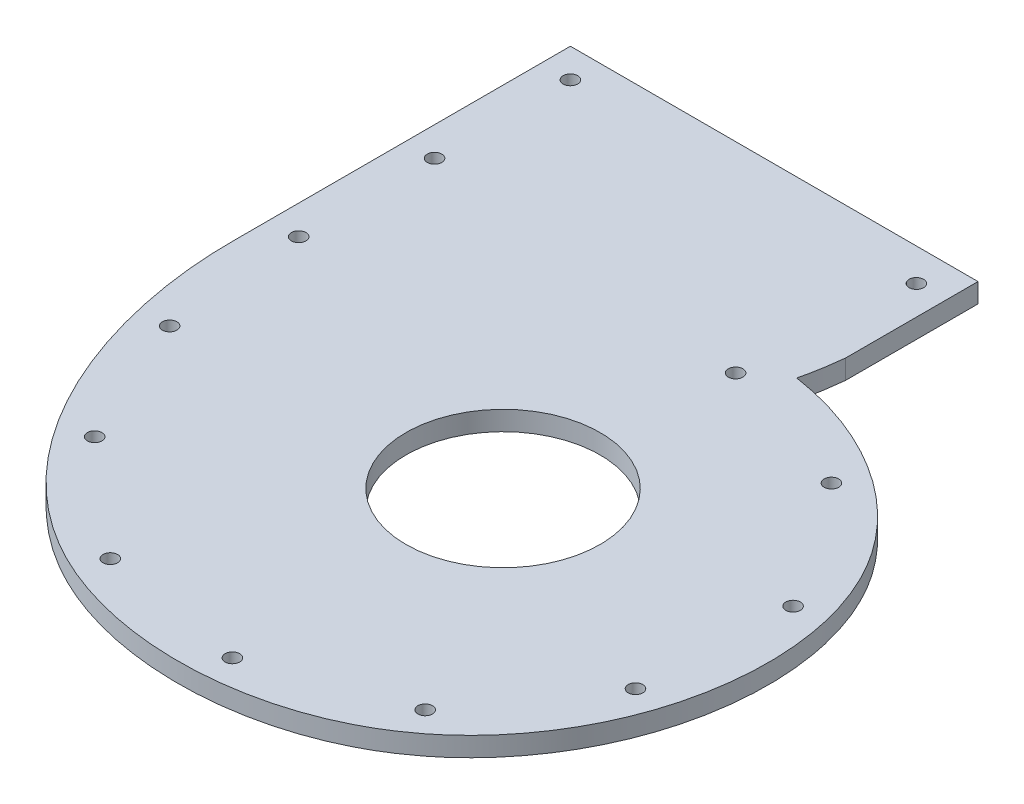
ISO-10303-21;
HEADER;
FILE_DESCRIPTION(('STEP AP214'),'2;1');
FILE_NAME('part.step','',(''),(''),'','','');
FILE_SCHEMA(('AUTOMOTIVE_DESIGN { 1 0 10303 214 1 1 1 1 }'));
ENDSEC;
DATA;
#1=APPLICATION_CONTEXT('core data for automotive mechanical design processes');
#2=APPLICATION_PROTOCOL_DEFINITION('international standard','automotive_design',2000,#1);
#3=PRODUCT_CONTEXT('',#1,'mechanical');
#4=PRODUCT('Part','Part','',(#3));
#5=PRODUCT_RELATED_PRODUCT_CATEGORY('part','',(#4));
#6=PRODUCT_DEFINITION_FORMATION('','',#4);
#7=PRODUCT_DEFINITION_CONTEXT('part definition',#1,'design');
#8=PRODUCT_DEFINITION('design','',#6,#7);
#9=PRODUCT_DEFINITION_SHAPE('','',#8);
#10=(LENGTH_UNIT() NAMED_UNIT(*) SI_UNIT(.MILLI.,.METRE.));
#11=(NAMED_UNIT(*) PLANE_ANGLE_UNIT() SI_UNIT($,.RADIAN.));
#12=(NAMED_UNIT(*) SI_UNIT($,.STERADIAN.) SOLID_ANGLE_UNIT());
#13=UNCERTAINTY_MEASURE_WITH_UNIT(LENGTH_MEASURE(1.E-05),#10,'distance_accuracy_value','');
#14=(GEOMETRIC_REPRESENTATION_CONTEXT(3) GLOBAL_UNCERTAINTY_ASSIGNED_CONTEXT((#13)) GLOBAL_UNIT_ASSIGNED_CONTEXT((#10,
#11,#12)) REPRESENTATION_CONTEXT('',''));
#15=CARTESIAN_POINT('',(0.,0.,0.));
#16=DIRECTION('',(0.,0.,1.));
#17=DIRECTION('',(1.,0.,0.));
#18=AXIS2_PLACEMENT_3D('',#15,#16,#17);
#19=CARTESIAN_POINT('',(19.05,6.35,-93.0525131214236));
#20=CARTESIAN_POINT('',(19.0235717626698,6.35,-92.8091366928728));
#21=CARTESIAN_POINT('',(18.9836928683942,6.35,-92.4430892244958));
#22=CARTESIAN_POINT('',(18.9314671624808,6.35,-91.9589572355302));
#23=CARTESIAN_POINT('',(18.8623607981838,6.35,-91.3379157509415));
#24=CARTESIAN_POINT('',(18.7762928711156,6.35,-90.6107808851603));
#25=CARTESIAN_POINT('',(18.6259027213404,6.35,-89.4251283904721));
#26=CARTESIAN_POINT('',(18.4201228683112,6.35,-87.9598584476399));
#27=CARTESIAN_POINT('',(18.0499905632596,6.35,-85.6275758075247));
#28=CARTESIAN_POINT('',(17.5101435713735,6.35,-82.7435971471794));
#29=CARTESIAN_POINT('',(16.996105498509,6.35,-80.4784646355363));
#30=CARTESIAN_POINT('',(16.7159863913014,6.35,-79.3485680085002));
#31=B_SPLINE_CURVE_WITH_KNOTS('',3,(#19,#20,#21,#22,#23,#24,#25,#26,#27,#28,#29,#30),
.UNSPECIFIED.,.F.,.F.,(4,1,1,1,1,1,1,1,1,4),(-0.0228949743215874,-0.00659054938911569,
0.00156166307712017,0.00971387554335602,0.0260183004758277,0.0423227254082994,
0.0749315752732429,0.107540425138186,0.172758124868073,0.23797582459796),.UNSPECIFIED.);
#32=DIRECTION('',(0.,-1.,0.));
#33=VECTOR('',#32,1.);
#34=SURFACE_OF_LINEAR_EXTRUSION('',#31,#33);
#35=CARTESIAN_POINT('',(19.05,0.,-93.0525131214236));
#36=CARTESIAN_POINT('',(19.0235717626698,0.,-92.8091366928728));
#37=CARTESIAN_POINT('',(18.9836928683942,0.,-92.4430892244958));
#38=CARTESIAN_POINT('',(18.9314671624808,0.,-91.9589572355302));
#39=CARTESIAN_POINT('',(18.8623607981838,0.,-91.3379157509415));
#40=CARTESIAN_POINT('',(18.7762928711156,0.,-90.6107808851603));
#41=CARTESIAN_POINT('',(18.6259027213404,0.,-89.4251283904721));
#42=CARTESIAN_POINT('',(18.4201228683112,0.,-87.9598584476399));
#43=CARTESIAN_POINT('',(18.0499905632596,0.,-85.6275758075247));
#44=CARTESIAN_POINT('',(17.5101435713735,0.,-82.7435971471794));
#45=CARTESIAN_POINT('',(16.996105498509,0.,-80.4784646355363));
#46=CARTESIAN_POINT('',(16.7159863913014,0.,-79.3485680085002));
#47=B_SPLINE_CURVE_WITH_KNOTS('',3,(#35,#36,#37,#38,#39,#40,#41,#42,#43,#44,#45,#46),
.UNSPECIFIED.,.F.,.F.,(4,1,1,1,1,1,1,1,1,4),(-0.0228949743215874,-0.00659054938911569,
0.00156166307712017,0.00971387554335602,0.0260183004758277,0.0423227254082994,
0.0749315752732429,0.107540425138186,0.172758124868073,0.23797582459796),.UNSPECIFIED.);
#48=CARTESIAN_POINT('',(19.05,0.,-93.0525131214236));
#49=VERTEX_POINT('',#48);
#50=CARTESIAN_POINT('',(16.7159863913014,0.,-79.3485680085002));
#51=VERTEX_POINT('',#50);
#52=EDGE_CURVE('E145',#49,#51,#47,.T.);
#53=ORIENTED_EDGE('',*,*,#52,.F.);
#54=DIRECTION('',(0.,-1.,0.));
#55=VECTOR('',#54,1.);
#56=CARTESIAN_POINT('',(19.05,6.35,-93.0525131214236));
#57=LINE('',#56,#55);
#58=CARTESIAN_POINT('',(19.05,6.35,-93.0525131214236));
#59=VERTEX_POINT('',#58);
#60=EDGE_CURVE('E13',#59,#49,#57,.T.);
#61=ORIENTED_EDGE('',*,*,#60,.F.);
#62=CARTESIAN_POINT('',(16.7159863913014,6.35,-79.3485680085002));
#63=VERTEX_POINT('',#62);
#64=EDGE_CURVE('E182',#59,#63,#31,.T.);
#65=ORIENTED_EDGE('',*,*,#64,.T.);
#66=DIRECTION('',(0.,-1.,0.));
#67=VECTOR('',#66,1.);
#68=CARTESIAN_POINT('',(16.7159863913014,6.35,-79.3485680085002));
#69=LINE('',#68,#67);
#70=EDGE_CURVE('E84',#63,#51,#69,.T.);
#71=ORIENTED_EDGE('',*,*,#70,.T.);
#72=EDGE_LOOP('',(#53,#61,#65,#71));
#73=FACE_BOUND('',#72,.T.);
#74=ADVANCED_FACE('F67',(#73),#34,.T.);
#75=CARTESIAN_POINT('',(19.05,6.35,0.));
#76=DIRECTION('',(1.,0.,0.));
#77=DIRECTION('',(0.,0.,-1.));
#78=AXIS2_PLACEMENT_3D('',#75,#76,#77);
#79=PLANE('',#78);
#80=DIRECTION('',(0.,0.,1.));
#81=VECTOR('',#80,1.);
#82=CARTESIAN_POINT('',(19.05,0.,0.));
#83=LINE('',#82,#81);
#84=CARTESIAN_POINT('',(19.05,0.,-136.334024978483));
#85=VERTEX_POINT('',#84);
#86=EDGE_CURVE('E170',#85,#49,#83,.T.);
#87=ORIENTED_EDGE('',*,*,#86,.F.);
#88=DIRECTION('',(0.,-1.,0.));
#89=VECTOR('',#88,1.);
#90=CARTESIAN_POINT('',(19.05,6.35,-136.334024978483));
#91=LINE('',#90,#89);
#92=CARTESIAN_POINT('',(19.05,6.35,-136.334024978483));
#93=VERTEX_POINT('',#92);
#94=EDGE_CURVE('E76',#93,#85,#91,.T.);
#95=ORIENTED_EDGE('',*,*,#94,.F.);
#96=DIRECTION('',(0.,0.,1.));
#97=VECTOR('',#96,1.);
#98=CARTESIAN_POINT('',(19.05,6.35,0.));
#99=LINE('',#98,#97);
#100=EDGE_CURVE('E125',#93,#59,#99,.T.);
#101=ORIENTED_EDGE('',*,*,#100,.T.);
#102=ORIENTED_EDGE('',*,*,#60,.T.);
#103=EDGE_LOOP('',(#87,#95,#101,#102));
#104=FACE_BOUND('',#103,.T.);
#105=ADVANCED_FACE('F162',(#104),#79,.T.);
#106=CARTESIAN_POINT('',(0.,6.35,-136.334024978483));
#107=DIRECTION('',(0.,0.,1.));
#108=DIRECTION('',(1.,0.,0.));
#109=AXIS2_PLACEMENT_3D('',#106,#107,#108);
#110=PLANE('',#109);
#111=DIRECTION('',(-1.,0.,0.));
#112=VECTOR('',#111,1.);
#113=CARTESIAN_POINT('',(0.,0.,-136.334024978483));
#114=LINE('',#113,#112);
#115=CARTESIAN_POINT('',(-114.3,0.,-136.334024978483));
#116=VERTEX_POINT('',#115);
#117=EDGE_CURVE('E132',#85,#116,#114,.T.);
#118=ORIENTED_EDGE('',*,*,#117,.T.);
#119=DIRECTION('',(0.,-1.,0.));
#120=VECTOR('',#119,1.);
#121=CARTESIAN_POINT('',(-114.3,6.35,-136.334024978483));
#122=LINE('',#121,#120);
#123=CARTESIAN_POINT('',(-114.3,6.35,-136.334024978483));
#124=VERTEX_POINT('',#123);
#125=EDGE_CURVE('E130',#124,#116,#122,.T.);
#126=ORIENTED_EDGE('',*,*,#125,.F.);
#127=DIRECTION('',(-1.,0.,0.));
#128=VECTOR('',#127,1.);
#129=CARTESIAN_POINT('',(0.,6.35,-136.334024978483));
#130=LINE('',#129,#128);
#131=EDGE_CURVE('E117',#93,#124,#130,.T.);
#132=ORIENTED_EDGE('',*,*,#131,.F.);
#133=ORIENTED_EDGE('',*,*,#94,.T.);
#134=EDGE_LOOP('',(#118,#126,#132,#133));
#135=FACE_BOUND('',#134,.T.);
#136=ADVANCED_FACE('F131',(#135),#110,.F.);
#137=CARTESIAN_POINT('',(-114.3,6.35,0.));
#138=DIRECTION('',(1.,0.,0.));
#139=DIRECTION('',(0.,0.,-1.));
#140=AXIS2_PLACEMENT_3D('',#137,#138,#139);
#141=PLANE('',#140);
#142=DIRECTION('',(0.,0.,1.));
#143=VECTOR('',#142,1.);
#144=CARTESIAN_POINT('',(-114.3,0.,0.));
#145=LINE('',#144,#143);
#146=CARTESIAN_POINT('',(-114.3,0.,-26.0721112281661));
#147=VERTEX_POINT('',#146);
#148=EDGE_CURVE('E172',#116,#147,#145,.T.);
#149=ORIENTED_EDGE('',*,*,#148,.T.);
#150=DIRECTION('',(0.,-1.,0.));
#151=VECTOR('',#150,1.);
#152=CARTESIAN_POINT('',(-114.3,6.35,-26.0721112281661));
#153=LINE('',#152,#151);
#154=CARTESIAN_POINT('',(-114.3,6.35,-26.0721112281661));
#155=VERTEX_POINT('',#154);
#156=EDGE_CURVE('E101',#155,#147,#153,.T.);
#157=ORIENTED_EDGE('',*,*,#156,.F.);
#158=DIRECTION('',(0.,0.,1.));
#159=VECTOR('',#158,1.);
#160=CARTESIAN_POINT('',(-114.3,6.35,0.));
#161=LINE('',#160,#159);
#162=EDGE_CURVE('E123',#124,#155,#161,.T.);
#163=ORIENTED_EDGE('',*,*,#162,.F.);
#164=ORIENTED_EDGE('',*,*,#125,.T.);
#165=EDGE_LOOP('',(#149,#157,#163,#164));
#166=FACE_BOUND('',#165,.T.);
#167=ADVANCED_FACE('F136',(#166),#141,.F.);
#168=CARTESIAN_POINT('',(16.7159863913014,6.35,-79.3485680085002));
#169=CARTESIAN_POINT('',(21.6330978705224,6.35,-78.6271989598531));
#170=CARTESIAN_POINT('',(31.3718572612699,6.35,-76.3897218941116));
#171=CARTESIAN_POINT('',(45.2492004972199,6.35,-70.8452769607163));
#172=CARTESIAN_POINT('',(58.1427020202069,6.35,-63.2023547019803));
#173=CARTESIAN_POINT('',(69.6942684990019,6.35,-53.48659400402));
#174=CARTESIAN_POINT('',(77.8316458808527,6.35,-43.6787438983676));
#175=CARTESIAN_POINT('',(83.1663553001762,6.35,-34.7783260421134));
#176=CARTESIAN_POINT('',(87.5006566564551,6.35,-25.5003387116442));
#177=CARTESIAN_POINT('',(91.1570644324476,6.35,-13.4000448880706));
#178=CARTESIAN_POINT('',(92.9989240789807,6.35,1.46366621805663));
#179=CARTESIAN_POINT('',(92.5331586276137,6.35,16.3321608555447));
#180=CARTESIAN_POINT('',(89.9113480457351,6.35,30.9228680078494));
#181=CARTESIAN_POINT('',(85.2246697026399,6.35,44.926534482478));
#182=CARTESIAN_POINT('',(78.5424766002794,6.35,58.0873215625547));
#183=CARTESIAN_POINT('',(69.8929665542091,6.35,70.1280882226925));
#184=CARTESIAN_POINT('',(59.3342250850972,6.35,80.7225189459671));
#185=CARTESIAN_POINT('',(46.8082946762808,6.35,89.4843789599546));
#186=CARTESIAN_POINT('',(33.1657508535722,6.35,95.8312045365591));
#187=CARTESIAN_POINT('',(18.8220757998214,6.35,100.000437450495));
#188=CARTESIAN_POINT('',(4.08382286145167,6.35,102.10160242432));
#189=CARTESIAN_POINT('',(-10.7774412230892,6.35,102.21979996101));
#190=CARTESIAN_POINT('',(-25.5048511364746,6.35,100.381408636179));
#191=CARTESIAN_POINT('',(-37.4527415030442,6.35,97.1973224935949));
#192=CARTESIAN_POINT('',(-46.6656390896169,6.35,93.6226539944936));
#193=CARTESIAN_POINT('',(-53.3782339827533,6.35,90.4042691275464));
#194=CARTESIAN_POINT('',(-59.7780191628772,6.35,86.6678318366041));
#195=CARTESIAN_POINT('',(-67.7729642470086,6.35,81.1134949695859));
#196=CARTESIAN_POINT('',(-76.7948383172267,6.35,73.1919966973664));
#197=CARTESIAN_POINT('',(-86.0825071986507,6.35,62.4802459776523));
#198=CARTESIAN_POINT('',(-96.5268651878926,6.35,46.9789350867326));
#199=CARTESIAN_POINT('',(-104.247410810002,6.35,30.1516401250863));
#200=CARTESIAN_POINT('',(-109.533831829891,6.35,12.8006946264713));
#201=CARTESIAN_POINT('',(-112.324631517154,6.35,-0.30605110665803));
#202=CARTESIAN_POINT('',(-113.69827349308,6.35,-11.1587802232802));
#203=CARTESIAN_POINT('',(-114.231429958165,6.35,-19.7408930873515));
#204=CARTESIAN_POINT('',(-114.308990647516,6.35,-23.9549561001606));
#205=CARTESIAN_POINT('',(-114.3,6.35,-26.0721112281661));
#206=B_SPLINE_CURVE_WITH_KNOTS('',3,(#168,#169,#170,#171,#172,#173,#174,#175,#176,#177,#178,
#179,#180,#181,#182,#183,#184,#185,#186,#187,#188,#189,#190,#191,#192,#193,#194,#195,#196,#197,
#198,#199,#200,#201,#202,#203,#204,#205),.UNSPECIFIED.,.F.,.F.,(4,1,1,1,1,1,1,1,1,1,1,1,1,1,1,1,
1,1,1,1,1,1,1,1,1,1,1,1,1,1,1,1,1,1,1,4),(0.0744180317666386,0.103339232907731,
0.132260434048823,0.161181635189916,0.190102836331008,0.2190240374721,0.233484638042646,
0.247945238613193,0.276866439754285,0.305787640895377,0.33470884203647,0.363630043177562,
0.392551244318654,0.421472445459747,0.450393646600839,0.479314847741931,0.508236048883024,
0.537157250024116,0.566078451165208,0.594999652306301,0.623920853447393,0.652842054588485,
0.681763255729578,0.696223856300124,0.71068445687067,0.725145057441216,0.739605658011762,
0.768526859152855,0.797448060293947,0.826369261435039,0.884211663717224,0.913132864858316,
0.942054065999409,0.970975267140501,0.985435867711047,0.999896468281593),.UNSPECIFIED.);
#207=DIRECTION('',(0.,-1.,0.));
#208=VECTOR('',#207,1.);
#209=SURFACE_OF_LINEAR_EXTRUSION('',#206,#208);
#210=CARTESIAN_POINT('',(16.7159863913014,0.,-79.3485680085002));
#211=CARTESIAN_POINT('',(21.6330978705224,0.,-78.6271989598531));
#212=CARTESIAN_POINT('',(31.3718572612699,0.,-76.3897218941116));
#213=CARTESIAN_POINT('',(45.2492004972199,0.,-70.8452769607163));
#214=CARTESIAN_POINT('',(58.1427020202069,0.,-63.2023547019803));
#215=CARTESIAN_POINT('',(69.6942684990019,0.,-53.48659400402));
#216=CARTESIAN_POINT('',(77.8316458808527,0.,-43.6787438983676));
#217=CARTESIAN_POINT('',(83.1663553001762,0.,-34.7783260421134));
#218=CARTESIAN_POINT('',(87.5006566564551,0.,-25.5003387116442));
#219=CARTESIAN_POINT('',(91.1570644324476,0.,-13.4000448880706));
#220=CARTESIAN_POINT('',(92.9989240789807,0.,1.46366621805663));
#221=CARTESIAN_POINT('',(92.5331586276137,0.,16.3321608555447));
#222=CARTESIAN_POINT('',(89.9113480457351,0.,30.9228680078494));
#223=CARTESIAN_POINT('',(85.2246697026399,0.,44.926534482478));
#224=CARTESIAN_POINT('',(78.5424766002794,0.,58.0873215625547));
#225=CARTESIAN_POINT('',(69.8929665542091,0.,70.1280882226925));
#226=CARTESIAN_POINT('',(59.3342250850972,0.,80.7225189459671));
#227=CARTESIAN_POINT('',(46.8082946762808,0.,89.4843789599546));
#228=CARTESIAN_POINT('',(33.1657508535722,0.,95.8312045365591));
#229=CARTESIAN_POINT('',(18.8220757998214,0.,100.000437450495));
#230=CARTESIAN_POINT('',(4.08382286145167,0.,102.10160242432));
#231=CARTESIAN_POINT('',(-10.7774412230892,0.,102.21979996101));
#232=CARTESIAN_POINT('',(-25.5048511364746,0.,100.381408636179));
#233=CARTESIAN_POINT('',(-37.4527415030442,0.,97.1973224935949));
#234=CARTESIAN_POINT('',(-46.6656390896169,0.,93.6226539944936));
#235=CARTESIAN_POINT('',(-53.3782339827533,0.,90.4042691275464));
#236=CARTESIAN_POINT('',(-59.7780191628772,0.,86.6678318366041));
#237=CARTESIAN_POINT('',(-67.7729642470086,0.,81.1134949695859));
#238=CARTESIAN_POINT('',(-76.7948383172267,0.,73.1919966973664));
#239=CARTESIAN_POINT('',(-86.0825071986507,0.,62.4802459776523));
#240=CARTESIAN_POINT('',(-96.5268651878926,0.,46.9789350867326));
#241=CARTESIAN_POINT('',(-104.247410810002,0.,30.1516401250863));
#242=CARTESIAN_POINT('',(-109.533831829891,0.,12.8006946264713));
#243=CARTESIAN_POINT('',(-112.324631517154,0.,-0.30605110665803));
#244=CARTESIAN_POINT('',(-113.69827349308,0.,-11.1587802232802));
#245=CARTESIAN_POINT('',(-114.231429958165,0.,-19.7408930873515));
#246=CARTESIAN_POINT('',(-114.308990647516,0.,-23.9549561001606));
#247=CARTESIAN_POINT('',(-114.3,0.,-26.0721112281661));
#248=B_SPLINE_CURVE_WITH_KNOTS('',3,(#210,#211,#212,#213,#214,#215,#216,#217,#218,#219,#220,
#221,#222,#223,#224,#225,#226,#227,#228,#229,#230,#231,#232,#233,#234,#235,#236,#237,#238,#239,
#240,#241,#242,#243,#244,#245,#246,#247),.UNSPECIFIED.,.F.,.F.,(4,1,1,1,1,1,1,1,1,1,1,1,1,1,1,1,
1,1,1,1,1,1,1,1,1,1,1,1,1,1,1,1,1,1,1,4),(0.0744180317666386,0.103339232907731,
0.132260434048823,0.161181635189916,0.190102836331008,0.2190240374721,0.233484638042646,
0.247945238613193,0.276866439754285,0.305787640895377,0.33470884203647,0.363630043177562,
0.392551244318654,0.421472445459747,0.450393646600839,0.479314847741931,0.508236048883024,
0.537157250024116,0.566078451165208,0.594999652306301,0.623920853447393,0.652842054588485,
0.681763255729578,0.696223856300124,0.71068445687067,0.725145057441216,0.739605658011762,
0.768526859152855,0.797448060293947,0.826369261435039,0.884211663717224,0.913132864858316,
0.942054065999409,0.970975267140501,0.985435867711047,0.999896468281593),.UNSPECIFIED.);
#249=EDGE_CURVE('E177',#51,#147,#248,.T.);
#250=ORIENTED_EDGE('',*,*,#249,.F.);
#251=ORIENTED_EDGE('',*,*,#70,.F.);
#252=EDGE_CURVE('E137',#63,#155,#206,.T.);
#253=ORIENTED_EDGE('',*,*,#252,.T.);
#254=ORIENTED_EDGE('',*,*,#156,.T.);
#255=EDGE_LOOP('',(#250,#251,#253,#254));
#256=FACE_BOUND('',#255,.T.);
#257=ADVANCED_FACE('F153',(#256),#209,.T.);
#258=CARTESIAN_POINT('',(0.,6.35,0.));
#259=DIRECTION('',(0.,1.,0.));
#260=DIRECTION('',(0.,0.,1.));
#261=AXIS2_PLACEMENT_3D('',#258,#259,#260);
#262=PLANE('',#261);
#263=CARTESIAN_POINT('',(9.52499999999998,6.34999999986404,-125.703541590997));
#264=DIRECTION('',(0.,1.,0.));
#265=DIRECTION('',(0.,0.,1.));
#266=AXIS2_PLACEMENT_3D('',#263,#264,#265);
#267=CIRCLE('',#266,2.38125);
#268=CARTESIAN_POINT('',(9.52499999999998,6.34999999986404,-123.322291590997));
#269=VERTEX_POINT('',#268);
#270=EDGE_CURVE('E266',#269,#269,#267,.T.);
#271=ORIENTED_EDGE('',*,*,#270,.F.);
#272=EDGE_LOOP('',(#271));
#273=FACE_BOUND('',#272,.T.);
#274=CARTESIAN_POINT('',(5.30214698446013,6.34999999987513,-70.7696736998972));
#275=DIRECTION('',(0.,1.,0.));
#276=DIRECTION('',(0.,0.,1.));
#277=AXIS2_PLACEMENT_3D('',#274,#275,#276);
#278=CIRCLE('',#277,2.38125);
#279=CARTESIAN_POINT('',(5.30214698446013,6.34999999987513,-68.3884236998972));
#280=VERTEX_POINT('',#279);
#281=EDGE_CURVE('E260',#280,#280,#278,.T.);
#282=ORIENTED_EDGE('',*,*,#281,.F.);
#283=EDGE_LOOP('',(#282));
#284=FACE_BOUND('',#283,.T.);
#285=CARTESIAN_POINT('',(52.1827380609273,6.34999999986884,-55.2474860426569));
#286=DIRECTION('',(0.,1.,0.));
#287=DIRECTION('',(0.,0.,1.));
#288=AXIS2_PLACEMENT_3D('',#285,#286,#287);
#289=CIRCLE('',#288,2.38125);
#290=CARTESIAN_POINT('',(52.1827380609273,6.34999999986884,-52.8662360426569));
#291=VERTEX_POINT('',#290);
#292=EDGE_CURVE('E254',#291,#291,#289,.T.);
#293=ORIENTED_EDGE('',*,*,#292,.F.);
#294=EDGE_LOOP('',(#293));
#295=FACE_BOUND('',#294,.T.);
#296=CARTESIAN_POINT('',(80.7824142416887,6.34999999986437,-14.1065356394769));
#297=DIRECTION('',(0.,1.,0.));
#298=DIRECTION('',(0.,0.,1.));
#299=AXIS2_PLACEMENT_3D('',#296,#297,#298);
#300=CIRCLE('',#299,2.38125);
#301=CARTESIAN_POINT('',(80.7824142416887,6.34999999986437,-11.7252856394769));
#302=VERTEX_POINT('',#301);
#303=EDGE_CURVE('E248',#302,#302,#300,.T.);
#304=ORIENTED_EDGE('',*,*,#303,.F.);
#305=EDGE_LOOP('',(#304));
#306=FACE_BOUND('',#305,.T.);
#307=CARTESIAN_POINT('',(78.3880407363537,6.34999999986463,35.05863295914));
#308=DIRECTION('',(0.,1.,0.));
#309=DIRECTION('',(0.,0.,1.));
#310=AXIS2_PLACEMENT_3D('',#307,#308,#309);
#311=CIRCLE('',#310,2.38125);
#312=CARTESIAN_POINT('',(78.3880407363537,6.34999999986463,37.43988295914));
#313=VERTEX_POINT('',#312);
#314=EDGE_CURVE('E242',#313,#313,#311,.T.);
#315=ORIENTED_EDGE('',*,*,#314,.F.);
#316=EDGE_LOOP('',(#315));
#317=FACE_BOUND('',#316,.T.);
#318=CARTESIAN_POINT('',(49.9706498896961,6.34999999986851,75.4506365341561));
#319=DIRECTION('',(0.,1.,0.));
#320=DIRECTION('',(0.,0.,1.));
#321=AXIS2_PLACEMENT_3D('',#318,#319,#320);
#322=CIRCLE('',#321,2.38125);
#323=CARTESIAN_POINT('',(49.9706498896961,6.34999999986851,77.8318865341562));
#324=VERTEX_POINT('',#323);
#325=EDGE_CURVE('E236',#324,#324,#322,.T.);
#326=ORIENTED_EDGE('',*,*,#325,.F.);
#327=EDGE_LOOP('',(#326));
#328=FACE_BOUND('',#327,.T.);
#329=CARTESIAN_POINT('',(3.69898710459614,6.34999999987448,92.2460743206198));
#330=DIRECTION('',(0.,1.,0.));
#331=DIRECTION('',(0.,0.,1.));
#332=AXIS2_PLACEMENT_3D('',#329,#330,#331);
#333=CIRCLE('',#332,2.38125);
#334=CARTESIAN_POINT('',(3.69898710459614,6.34999999987448,94.6273243206198));
#335=VERTEX_POINT('',#334);
#336=EDGE_CURVE('E230',#335,#335,#333,.T.);
#337=ORIENTED_EDGE('',*,*,#336,.F.);
#338=EDGE_LOOP('',(#337));
#339=FACE_BOUND('',#338,.T.);
#340=CARTESIAN_POINT('',(-44.376132313222,6.34999999988007,84.1129830272196));
#341=DIRECTION('',(0.,1.,0.));
#342=DIRECTION('',(0.,0.,1.));
#343=AXIS2_PLACEMENT_3D('',#340,#341,#342);
#344=CIRCLE('',#343,2.38125);
#345=CARTESIAN_POINT('',(-44.376132313222,6.34999999988007,86.4942330272196));
#346=VERTEX_POINT('',#345);
#347=EDGE_CURVE('E224',#346,#346,#344,.T.);
#348=ORIENTED_EDGE('',*,*,#347,.F.);
#349=EDGE_LOOP('',(#348));
#350=FACE_BOUND('',#349,.T.);
#351=CARTESIAN_POINT('',(-81.4745539995221,6.34999999988469,52.1414717650409));
#352=DIRECTION('',(0.,1.,0.));
#353=DIRECTION('',(0.,0.,1.));
#354=AXIS2_PLACEMENT_3D('',#351,#352,#353);
#355=CIRCLE('',#354,2.38125);
#356=CARTESIAN_POINT('',(-81.4745539995221,6.34999999988469,54.5227217650409));
#357=VERTEX_POINT('',#356);
#358=EDGE_CURVE('E218',#357,#357,#355,.T.);
#359=ORIENTED_EDGE('',*,*,#358,.F.);
#360=EDGE_LOOP('',(#359));
#361=FACE_BOUND('',#360,.T.);
#362=CARTESIAN_POINT('',(-100.597903534507,6.34999999988637,8.4863561783266));
#363=DIRECTION('',(0.,1.,0.));
#364=DIRECTION('',(0.,0.,1.));
#365=AXIS2_PLACEMENT_3D('',#362,#363,#364);
#366=CIRCLE('',#365,2.38125);
#367=CARTESIAN_POINT('',(-100.597903534507,6.34999999988637,10.8676061783266));
#368=VERTEX_POINT('',#367);
#369=EDGE_CURVE('E212',#368,#368,#366,.T.);
#370=ORIENTED_EDGE('',*,*,#369,.F.);
#371=EDGE_LOOP('',(#370));
#372=FACE_BOUND('',#371,.T.);
#373=CARTESIAN_POINT('',(-104.775,6.3499999998867,-37.9090249784825));
#374=DIRECTION('',(0.,1.,0.));
#375=DIRECTION('',(0.,0.,1.));
#376=AXIS2_PLACEMENT_3D('',#373,#374,#375);
#377=CIRCLE('',#376,2.38125);
#378=CARTESIAN_POINT('',(-104.775,6.3499999998867,-35.5277749784825));
#379=VERTEX_POINT('',#378);
#380=EDGE_CURVE('E206',#379,#379,#377,.T.);
#381=ORIENTED_EDGE('',*,*,#380,.F.);
#382=EDGE_LOOP('',(#381));
#383=FACE_BOUND('',#382,.T.);
#384=CARTESIAN_POINT('',(-104.775,6.3499999998867,-82.3590249784825));
#385=DIRECTION('',(0.,1.,0.));
#386=DIRECTION('',(0.,0.,1.));
#387=AXIS2_PLACEMENT_3D('',#384,#385,#386);
#388=CIRCLE('',#387,2.38125);
#389=CARTESIAN_POINT('',(-104.775,6.3499999998867,-79.9777749784825));
#390=VERTEX_POINT('',#389);
#391=EDGE_CURVE('E200',#390,#390,#388,.T.);
#392=ORIENTED_EDGE('',*,*,#391,.F.);
#393=EDGE_LOOP('',(#392));
#394=FACE_BOUND('',#393,.T.);
#395=CARTESIAN_POINT('',(-104.775,6.35,-126.809024978483));
#396=DIRECTION('',(0.,1.,0.));
#397=DIRECTION('',(0.,0.,1.));
#398=AXIS2_PLACEMENT_3D('',#395,#396,#397);
#399=CIRCLE('',#398,2.38125);
#400=CARTESIAN_POINT('',(-104.775,6.35,-124.427774978483));
#401=VERTEX_POINT('',#400);
#402=EDGE_CURVE('E191',#401,#401,#399,.T.);
#403=ORIENTED_EDGE('',*,*,#402,.F.);
#404=EDGE_LOOP('',(#403));
#405=FACE_BOUND('',#404,.T.);
#406=ORIENTED_EDGE('',*,*,#131,.T.);
#407=ORIENTED_EDGE('',*,*,#162,.T.);
#408=ORIENTED_EDGE('',*,*,#252,.F.);
#409=ORIENTED_EDGE('',*,*,#64,.F.);
#410=ORIENTED_EDGE('',*,*,#100,.F.);
#411=EDGE_LOOP('',(#406,#407,#408,#409,#410));
#412=FACE_BOUND('',#411,.T.);
#413=CARTESIAN_POINT('',(0.,6.35,0.));
#414=DIRECTION('',(0.,1.,0.));
#415=DIRECTION('',(0.,0.,1.));
#416=AXIS2_PLACEMENT_3D('',#413,#414,#415);
#417=CIRCLE('',#416,31.75);
#418=CARTESIAN_POINT('',(0.,6.35,31.75));
#419=VERTEX_POINT('',#418);
#420=EDGE_CURVE('E272',#419,#419,#417,.T.);
#421=ORIENTED_EDGE('',*,*,#420,.F.);
#422=EDGE_LOOP('',(#421));
#423=FACE_BOUND('',#422,.T.);
#424=ADVANCED_FACE('F119',(#273,#284,#295,#306,#317,#328,#339,#350,#361,#372,#383,#394,#405,
#412,#423),#262,.T.);
#425=CARTESIAN_POINT('',(0.,0.,0.));
#426=DIRECTION('',(0.,1.,0.));
#427=DIRECTION('',(0.,0.,1.));
#428=AXIS2_PLACEMENT_3D('',#425,#426,#427);
#429=PLANE('',#428);
#430=ORIENTED_EDGE('',*,*,#117,.F.);
#431=ORIENTED_EDGE('',*,*,#86,.T.);
#432=ORIENTED_EDGE('',*,*,#52,.T.);
#433=ORIENTED_EDGE('',*,*,#249,.T.);
#434=ORIENTED_EDGE('',*,*,#148,.F.);
#435=EDGE_LOOP('',(#430,#431,#432,#433,#434));
#436=FACE_BOUND('',#435,.T.);
#437=CARTESIAN_POINT('',(9.52499999999998,-1.3596415660011E-10,-125.703541590997));
#438=DIRECTION('',(0.,1.,0.));
#439=DIRECTION('',(0.,0.,1.));
#440=AXIS2_PLACEMENT_3D('',#437,#438,#439);
#441=CIRCLE('',#440,2.38125);
#442=CARTESIAN_POINT('',(9.52499999999998,-1.3596415660011E-10,-123.322291590997));
#443=VERTEX_POINT('',#442);
#444=EDGE_CURVE('E263',#443,#443,#441,.T.);
#445=ORIENTED_EDGE('',*,*,#444,.T.);
#446=EDGE_LOOP('',(#445));
#447=FACE_BOUND('',#446,.T.);
#448=CARTESIAN_POINT('',(5.30214698446013,-1.2487406941819E-10,-70.7696736998972));
#449=DIRECTION('',(0.,1.,0.));
#450=DIRECTION('',(0.,0.,1.));
#451=AXIS2_PLACEMENT_3D('',#448,#449,#450);
#452=CIRCLE('',#451,2.38125);
#453=CARTESIAN_POINT('',(5.30214698446013,-1.2487406941819E-10,-68.3884236998972));
#454=VERTEX_POINT('',#453);
#455=EDGE_CURVE('E257',#454,#454,#452,.T.);
#456=ORIENTED_EDGE('',*,*,#455,.T.);
#457=EDGE_LOOP('',(#456));
#458=FACE_BOUND('',#457,.T.);
#459=CARTESIAN_POINT('',(52.1827380609273,-1.31162442018606E-10,-55.2474860426569));
#460=DIRECTION('',(0.,1.,0.));
#461=DIRECTION('',(0.,0.,1.));
#462=AXIS2_PLACEMENT_3D('',#459,#460,#461);
#463=CIRCLE('',#462,2.38125);
#464=CARTESIAN_POINT('',(52.1827380609273,-1.31162442018606E-10,-52.8662360426569));
#465=VERTEX_POINT('',#464);
#466=EDGE_CURVE('E251',#465,#465,#463,.T.);
#467=ORIENTED_EDGE('',*,*,#466,.T.);
#468=EDGE_LOOP('',(#467));
#469=FACE_BOUND('',#468,.T.);
#470=CARTESIAN_POINT('',(80.7824142416887,-1.35625885522295E-10,-14.1065356394769));
#471=DIRECTION('',(0.,1.,0.));
#472=DIRECTION('',(0.,0.,1.));
#473=AXIS2_PLACEMENT_3D('',#470,#471,#472);
#474=CIRCLE('',#473,2.38125);
#475=CARTESIAN_POINT('',(80.7824142416887,-1.35625885522295E-10,-11.7252856394769));
#476=VERTEX_POINT('',#475);
#477=EDGE_CURVE('E245',#476,#476,#474,.T.);
#478=ORIENTED_EDGE('',*,*,#477,.T.);
#479=EDGE_LOOP('',(#478));
#480=FACE_BOUND('',#479,.T.);
#481=CARTESIAN_POINT('',(78.3880407363537,-1.3536914644785E-10,35.05863295914));
#482=DIRECTION('',(0.,1.,0.));
#483=DIRECTION('',(0.,0.,1.));
#484=AXIS2_PLACEMENT_3D('',#481,#482,#483);
#485=CIRCLE('',#484,2.38125);
#486=CARTESIAN_POINT('',(78.3880407363537,-1.3536914644785E-10,37.43988295914));
#487=VERTEX_POINT('',#486);
#488=EDGE_CURVE('E239',#487,#487,#485,.T.);
#489=ORIENTED_EDGE('',*,*,#488,.T.);
#490=EDGE_LOOP('',(#489));
#491=FACE_BOUND('',#490,.T.);
#492=CARTESIAN_POINT('',(49.9706498896961,-1.3149290684078E-10,75.4506365341561));
#493=DIRECTION('',(0.,1.,0.));
#494=DIRECTION('',(0.,0.,1.));
#495=AXIS2_PLACEMENT_3D('',#492,#493,#494);
#496=CIRCLE('',#495,2.38125);
#497=CARTESIAN_POINT('',(49.9706498896961,-1.3149290684078E-10,77.8318865341562));
#498=VERTEX_POINT('',#497);
#499=EDGE_CURVE('E233',#498,#498,#496,.T.);
#500=ORIENTED_EDGE('',*,*,#499,.T.);
#501=EDGE_LOOP('',(#500));
#502=FACE_BOUND('',#501,.T.);
#503=CARTESIAN_POINT('',(3.69898710459614,-1.25520253912992E-10,92.2460743206198));
#504=DIRECTION('',(0.,1.,0.));
#505=DIRECTION('',(0.,0.,1.));
#506=AXIS2_PLACEMENT_3D('',#503,#504,#505);
#507=CIRCLE('',#506,2.38125);
#508=CARTESIAN_POINT('',(3.69898710459614,-1.25520253912992E-10,94.6273243206198));
#509=VERTEX_POINT('',#508);
#510=EDGE_CURVE('E227',#509,#509,#507,.T.);
#511=ORIENTED_EDGE('',*,*,#510,.T.);
#512=EDGE_LOOP('',(#511));
#513=FACE_BOUND('',#512,.T.);
#514=CARTESIAN_POINT('',(-44.376132313222,-1.19930974873395E-10,84.1129830272196));
#515=DIRECTION('',(0.,1.,0.));
#516=DIRECTION('',(0.,0.,1.));
#517=AXIS2_PLACEMENT_3D('',#514,#515,#516);
#518=CIRCLE('',#517,2.38125);
#519=CARTESIAN_POINT('',(-44.376132313222,-1.19930974873395E-10,86.4942330272196));
#520=VERTEX_POINT('',#519);
#521=EDGE_CURVE('E221',#520,#520,#518,.T.);
#522=ORIENTED_EDGE('',*,*,#521,.T.);
#523=EDGE_LOOP('',(#522));
#524=FACE_BOUND('',#523,.T.);
#525=CARTESIAN_POINT('',(-81.4745539995221,-1.15307936809916E-10,52.1414717650409));
#526=DIRECTION('',(0.,1.,0.));
#527=DIRECTION('',(0.,0.,1.));
#528=AXIS2_PLACEMENT_3D('',#525,#526,#527);
#529=CIRCLE('',#528,2.38125);
#530=CARTESIAN_POINT('',(-81.4745539995221,-1.15307936809916E-10,54.5227217650409));
#531=VERTEX_POINT('',#530);
#532=EDGE_CURVE('E215',#531,#531,#529,.T.);
#533=ORIENTED_EDGE('',*,*,#532,.T.);
#534=EDGE_LOOP('',(#533));
#535=FACE_BOUND('',#534,.T.);
#536=CARTESIAN_POINT('',(-100.597903534507,-1.13626989761695E-10,8.4863561783266));
#537=DIRECTION('',(0.,1.,0.));
#538=DIRECTION('',(0.,0.,1.));
#539=AXIS2_PLACEMENT_3D('',#536,#537,#538);
#540=CIRCLE('',#539,2.38125);
#541=CARTESIAN_POINT('',(-100.597903534507,-1.13626989761695E-10,10.8676061783266));
#542=VERTEX_POINT('',#541);
#543=EDGE_CURVE('E209',#542,#542,#540,.T.);
#544=ORIENTED_EDGE('',*,*,#543,.T.);
#545=EDGE_LOOP('',(#544));
#546=FACE_BOUND('',#545,.T.);
#547=CARTESIAN_POINT('',(-104.775,-1.13303463833425E-10,-37.9090249784825));
#548=DIRECTION('',(0.,1.,0.));
#549=DIRECTION('',(0.,0.,1.));
#550=AXIS2_PLACEMENT_3D('',#547,#548,#549);
#551=CIRCLE('',#550,2.38125);
#552=CARTESIAN_POINT('',(-104.775,-1.13303463833425E-10,-35.5277749784825));
#553=VERTEX_POINT('',#552);
#554=EDGE_CURVE('E203',#553,#553,#551,.T.);
#555=ORIENTED_EDGE('',*,*,#554,.T.);
#556=EDGE_LOOP('',(#555));
#557=FACE_BOUND('',#556,.T.);
#558=CARTESIAN_POINT('',(-104.775,-1.13303463833425E-10,-82.3590249784825));
#559=DIRECTION('',(0.,1.,0.));
#560=DIRECTION('',(0.,0.,1.));
#561=AXIS2_PLACEMENT_3D('',#558,#559,#560);
#562=CIRCLE('',#561,2.38125);
#563=CARTESIAN_POINT('',(-104.775,-1.13303463833425E-10,-79.9777749784825));
#564=VERTEX_POINT('',#563);
#565=EDGE_CURVE('E197',#564,#564,#562,.T.);
#566=ORIENTED_EDGE('',*,*,#565,.T.);
#567=EDGE_LOOP('',(#566));
#568=FACE_BOUND('',#567,.T.);
#569=CARTESIAN_POINT('',(-104.775,0.,-126.809024978483));
#570=DIRECTION('',(0.,1.,0.));
#571=DIRECTION('',(0.,0.,1.));
#572=AXIS2_PLACEMENT_3D('',#569,#570,#571);
#573=CIRCLE('',#572,2.38125);
#574=CARTESIAN_POINT('',(-104.775,0.,-124.427774978483));
#575=VERTEX_POINT('',#574);
#576=EDGE_CURVE('E174',#575,#575,#573,.T.);
#577=ORIENTED_EDGE('',*,*,#576,.T.);
#578=EDGE_LOOP('',(#577));
#579=FACE_BOUND('',#578,.T.);
#580=CARTESIAN_POINT('',(0.,0.,0.));
#581=DIRECTION('',(0.,1.,0.));
#582=DIRECTION('',(0.,0.,1.));
#583=AXIS2_PLACEMENT_3D('',#580,#581,#582);
#584=CIRCLE('',#583,31.75);
#585=CARTESIAN_POINT('',(0.,0.,31.75));
#586=VERTEX_POINT('',#585);
#587=EDGE_CURVE('E269',#586,#586,#584,.T.);
#588=ORIENTED_EDGE('',*,*,#587,.T.);
#589=EDGE_LOOP('',(#588));
#590=FACE_BOUND('',#589,.T.);
#591=ADVANCED_FACE('F157',(#436,#447,#458,#469,#480,#491,#502,#513,#524,#535,#546,#557,#568,
#579,#590),#429,.F.);
#592=CARTESIAN_POINT('',(-104.775,0.,-126.809024978483));
#593=DIRECTION('',(0.,1.,0.));
#594=DIRECTION('',(0.,0.,1.));
#595=AXIS2_PLACEMENT_3D('',#592,#593,#594);
#596=CYLINDRICAL_SURFACE('',#595,2.38125);
#597=ORIENTED_EDGE('',*,*,#576,.F.);
#598=EDGE_LOOP('',(#597));
#599=FACE_BOUND('',#598,.T.);
#600=ORIENTED_EDGE('',*,*,#402,.T.);
#601=EDGE_LOOP('',(#600));
#602=FACE_BOUND('',#601,.T.);
#603=ADVANCED_FACE('F290',(#599,#602),#596,.F.);
#604=CARTESIAN_POINT('',(-104.775,-1.13303463833425E-10,-82.3590249784825));
#605=DIRECTION('',(0.,1.,0.));
#606=DIRECTION('',(0.,0.,1.));
#607=AXIS2_PLACEMENT_3D('',#604,#605,#606);
#608=CYLINDRICAL_SURFACE('',#607,2.38125);
#609=ORIENTED_EDGE('',*,*,#565,.F.);
#610=EDGE_LOOP('',(#609));
#611=FACE_BOUND('',#610,.T.);
#612=ORIENTED_EDGE('',*,*,#391,.T.);
#613=EDGE_LOOP('',(#612));
#614=FACE_BOUND('',#613,.T.);
#615=ADVANCED_FACE('F296',(#611,#614),#608,.F.);
#616=CARTESIAN_POINT('',(-104.775,-1.13303463833425E-10,-37.9090249784825));
#617=DIRECTION('',(0.,1.,0.));
#618=DIRECTION('',(0.,0.,1.));
#619=AXIS2_PLACEMENT_3D('',#616,#617,#618);
#620=CYLINDRICAL_SURFACE('',#619,2.38125);
#621=ORIENTED_EDGE('',*,*,#554,.F.);
#622=EDGE_LOOP('',(#621));
#623=FACE_BOUND('',#622,.T.);
#624=ORIENTED_EDGE('',*,*,#380,.T.);
#625=EDGE_LOOP('',(#624));
#626=FACE_BOUND('',#625,.T.);
#627=ADVANCED_FACE('F300',(#623,#626),#620,.F.);
#628=CARTESIAN_POINT('',(-100.597903534507,-1.13626989761695E-10,8.4863561783266));
#629=DIRECTION('',(0.,1.,0.));
#630=DIRECTION('',(0.,0.,1.));
#631=AXIS2_PLACEMENT_3D('',#628,#629,#630);
#632=CYLINDRICAL_SURFACE('',#631,2.38125);
#633=ORIENTED_EDGE('',*,*,#543,.F.);
#634=EDGE_LOOP('',(#633));
#635=FACE_BOUND('',#634,.T.);
#636=ORIENTED_EDGE('',*,*,#369,.T.);
#637=EDGE_LOOP('',(#636));
#638=FACE_BOUND('',#637,.T.);
#639=ADVANCED_FACE('F304',(#635,#638),#632,.F.);
#640=CARTESIAN_POINT('',(-81.4745539995221,-1.15307936809916E-10,52.1414717650409));
#641=DIRECTION('',(0.,1.,0.));
#642=DIRECTION('',(0.,0.,1.));
#643=AXIS2_PLACEMENT_3D('',#640,#641,#642);
#644=CYLINDRICAL_SURFACE('',#643,2.38125);
#645=ORIENTED_EDGE('',*,*,#532,.F.);
#646=EDGE_LOOP('',(#645));
#647=FACE_BOUND('',#646,.T.);
#648=ORIENTED_EDGE('',*,*,#358,.T.);
#649=EDGE_LOOP('',(#648));
#650=FACE_BOUND('',#649,.T.);
#651=ADVANCED_FACE('F308',(#647,#650),#644,.F.);
#652=CARTESIAN_POINT('',(-44.376132313222,-1.19930974873395E-10,84.1129830272196));
#653=DIRECTION('',(0.,1.,0.));
#654=DIRECTION('',(0.,0.,1.));
#655=AXIS2_PLACEMENT_3D('',#652,#653,#654);
#656=CYLINDRICAL_SURFACE('',#655,2.38125);
#657=ORIENTED_EDGE('',*,*,#521,.F.);
#658=EDGE_LOOP('',(#657));
#659=FACE_BOUND('',#658,.T.);
#660=ORIENTED_EDGE('',*,*,#347,.T.);
#661=EDGE_LOOP('',(#660));
#662=FACE_BOUND('',#661,.T.);
#663=ADVANCED_FACE('F312',(#659,#662),#656,.F.);
#664=CARTESIAN_POINT('',(3.69898710459614,-1.25520253912992E-10,92.2460743206198));
#665=DIRECTION('',(0.,1.,0.));
#666=DIRECTION('',(0.,0.,1.));
#667=AXIS2_PLACEMENT_3D('',#664,#665,#666);
#668=CYLINDRICAL_SURFACE('',#667,2.38125);
#669=ORIENTED_EDGE('',*,*,#510,.F.);
#670=EDGE_LOOP('',(#669));
#671=FACE_BOUND('',#670,.T.);
#672=ORIENTED_EDGE('',*,*,#336,.T.);
#673=EDGE_LOOP('',(#672));
#674=FACE_BOUND('',#673,.T.);
#675=ADVANCED_FACE('F316',(#671,#674),#668,.F.);
#676=CARTESIAN_POINT('',(49.9706498896961,-1.3149290684078E-10,75.4506365341561));
#677=DIRECTION('',(0.,1.,0.));
#678=DIRECTION('',(0.,0.,1.));
#679=AXIS2_PLACEMENT_3D('',#676,#677,#678);
#680=CYLINDRICAL_SURFACE('',#679,2.38125);
#681=ORIENTED_EDGE('',*,*,#499,.F.);
#682=EDGE_LOOP('',(#681));
#683=FACE_BOUND('',#682,.T.);
#684=ORIENTED_EDGE('',*,*,#325,.T.);
#685=EDGE_LOOP('',(#684));
#686=FACE_BOUND('',#685,.T.);
#687=ADVANCED_FACE('F320',(#683,#686),#680,.F.);
#688=CARTESIAN_POINT('',(78.3880407363537,-1.3536914644785E-10,35.05863295914));
#689=DIRECTION('',(0.,1.,0.));
#690=DIRECTION('',(0.,0.,1.));
#691=AXIS2_PLACEMENT_3D('',#688,#689,#690);
#692=CYLINDRICAL_SURFACE('',#691,2.38125);
#693=ORIENTED_EDGE('',*,*,#488,.F.);
#694=EDGE_LOOP('',(#693));
#695=FACE_BOUND('',#694,.T.);
#696=ORIENTED_EDGE('',*,*,#314,.T.);
#697=EDGE_LOOP('',(#696));
#698=FACE_BOUND('',#697,.T.);
#699=ADVANCED_FACE('F324',(#695,#698),#692,.F.);
#700=CARTESIAN_POINT('',(80.7824142416887,-1.35625885522295E-10,-14.1065356394769));
#701=DIRECTION('',(0.,1.,0.));
#702=DIRECTION('',(0.,0.,1.));
#703=AXIS2_PLACEMENT_3D('',#700,#701,#702);
#704=CYLINDRICAL_SURFACE('',#703,2.38125);
#705=ORIENTED_EDGE('',*,*,#477,.F.);
#706=EDGE_LOOP('',(#705));
#707=FACE_BOUND('',#706,.T.);
#708=ORIENTED_EDGE('',*,*,#303,.T.);
#709=EDGE_LOOP('',(#708));
#710=FACE_BOUND('',#709,.T.);
#711=ADVANCED_FACE('F328',(#707,#710),#704,.F.);
#712=CARTESIAN_POINT('',(52.1827380609273,-1.31162442018606E-10,-55.2474860426569));
#713=DIRECTION('',(0.,1.,0.));
#714=DIRECTION('',(0.,0.,1.));
#715=AXIS2_PLACEMENT_3D('',#712,#713,#714);
#716=CYLINDRICAL_SURFACE('',#715,2.38125);
#717=ORIENTED_EDGE('',*,*,#466,.F.);
#718=EDGE_LOOP('',(#717));
#719=FACE_BOUND('',#718,.T.);
#720=ORIENTED_EDGE('',*,*,#292,.T.);
#721=EDGE_LOOP('',(#720));
#722=FACE_BOUND('',#721,.T.);
#723=ADVANCED_FACE('F332',(#719,#722),#716,.F.);
#724=CARTESIAN_POINT('',(5.30214698446013,-1.2487406941819E-10,-70.7696736998972));
#725=DIRECTION('',(0.,1.,0.));
#726=DIRECTION('',(0.,0.,1.));
#727=AXIS2_PLACEMENT_3D('',#724,#725,#726);
#728=CYLINDRICAL_SURFACE('',#727,2.38125);
#729=ORIENTED_EDGE('',*,*,#455,.F.);
#730=EDGE_LOOP('',(#729));
#731=FACE_BOUND('',#730,.T.);
#732=ORIENTED_EDGE('',*,*,#281,.T.);
#733=EDGE_LOOP('',(#732));
#734=FACE_BOUND('',#733,.T.);
#735=ADVANCED_FACE('F336',(#731,#734),#728,.F.);
#736=CARTESIAN_POINT('',(9.52499999999998,-1.3596415660011E-10,-125.703541590997));
#737=DIRECTION('',(0.,1.,0.));
#738=DIRECTION('',(0.,0.,1.));
#739=AXIS2_PLACEMENT_3D('',#736,#737,#738);
#740=CYLINDRICAL_SURFACE('',#739,2.38125);
#741=ORIENTED_EDGE('',*,*,#444,.F.);
#742=EDGE_LOOP('',(#741));
#743=FACE_BOUND('',#742,.T.);
#744=ORIENTED_EDGE('',*,*,#270,.T.);
#745=EDGE_LOOP('',(#744));
#746=FACE_BOUND('',#745,.T.);
#747=ADVANCED_FACE('F282',(#743,#746),#740,.F.);
#748=CARTESIAN_POINT('',(0.,0.,0.));
#749=DIRECTION('',(0.,1.,0.));
#750=DIRECTION('',(0.,0.,1.));
#751=AXIS2_PLACEMENT_3D('',#748,#749,#750);
#752=CYLINDRICAL_SURFACE('',#751,31.75);
#753=ORIENTED_EDGE('',*,*,#587,.F.);
#754=EDGE_LOOP('',(#753));
#755=FACE_BOUND('',#754,.T.);
#756=ORIENTED_EDGE('',*,*,#420,.T.);
#757=EDGE_LOOP('',(#756));
#758=FACE_BOUND('',#757,.T.);
#759=ADVANCED_FACE('F279',(#755,#758),#752,.F.);
#760=CLOSED_SHELL('',(#74,#105,#136,#167,#257,#424,#591,#603,#615,#627,#639,#651,#663,#675,#687,
#699,#711,#723,#735,#747,#759));
#761=MANIFOLD_SOLID_BREP('B2',#760);
#762=ADVANCED_BREP_SHAPE_REPRESENTATION('',(#18,#761),#14);
#763=SHAPE_DEFINITION_REPRESENTATION(#9,#762);
ENDSEC;
END-ISO-10303-21;
